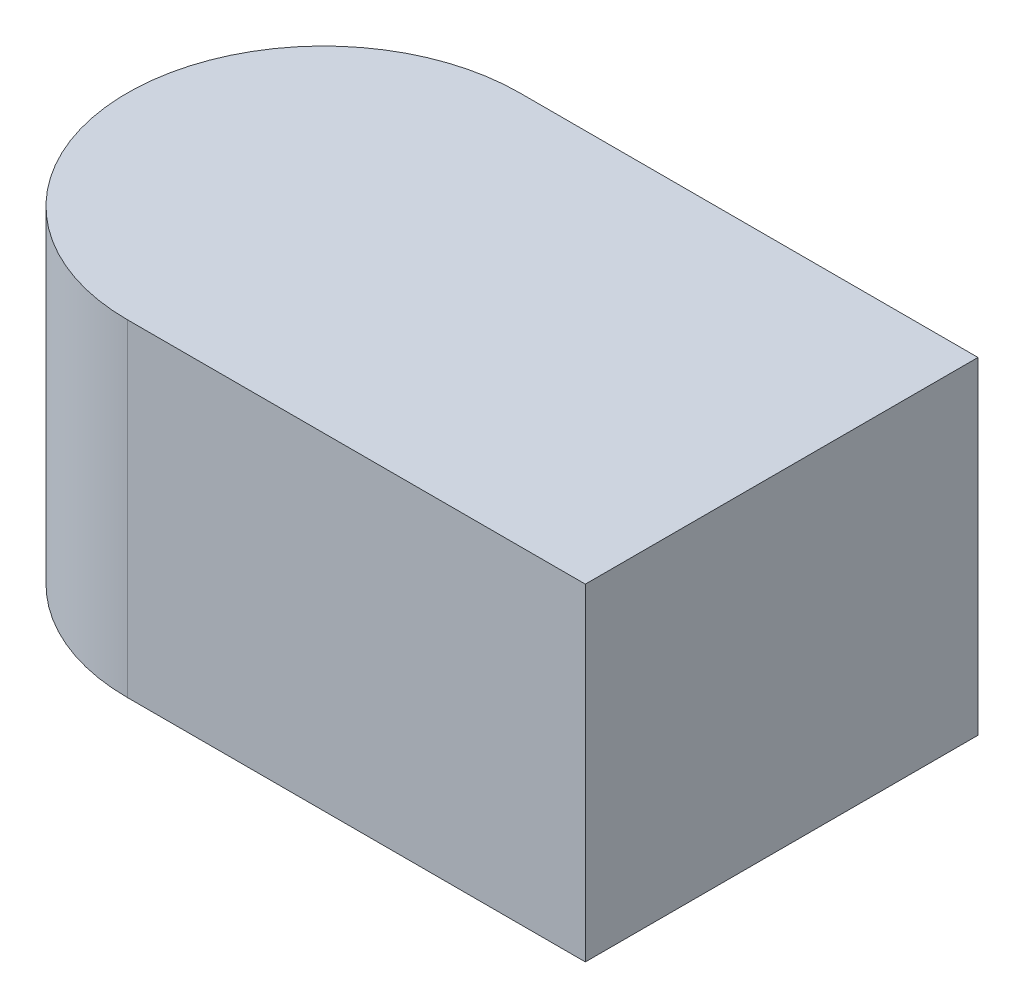
ISO-10303-21;
HEADER;
FILE_DESCRIPTION(('STEP AP214'),'2;1');
FILE_NAME('part.step','',(''),(''),'','','');
FILE_SCHEMA(('AUTOMOTIVE_DESIGN { 1 0 10303 214 1 1 1 1 }'));
ENDSEC;
DATA;
#1=APPLICATION_CONTEXT('core data for automotive mechanical design processes');
#2=APPLICATION_PROTOCOL_DEFINITION('international standard','automotive_design',2000,#1);
#3=PRODUCT_CONTEXT('',#1,'mechanical');
#4=PRODUCT('Part','Part','',(#3));
#5=PRODUCT_RELATED_PRODUCT_CATEGORY('part','',(#4));
#6=PRODUCT_DEFINITION_FORMATION('','',#4);
#7=PRODUCT_DEFINITION_CONTEXT('part definition',#1,'design');
#8=PRODUCT_DEFINITION('design','',#6,#7);
#9=PRODUCT_DEFINITION_SHAPE('','',#8);
#10=(LENGTH_UNIT() NAMED_UNIT(*) SI_UNIT(.MILLI.,.METRE.));
#11=(NAMED_UNIT(*) PLANE_ANGLE_UNIT() SI_UNIT($,.RADIAN.));
#12=(NAMED_UNIT(*) SI_UNIT($,.STERADIAN.) SOLID_ANGLE_UNIT());
#13=UNCERTAINTY_MEASURE_WITH_UNIT(LENGTH_MEASURE(1.E-05),#10,'distance_accuracy_value','');
#14=(GEOMETRIC_REPRESENTATION_CONTEXT(3) GLOBAL_UNCERTAINTY_ASSIGNED_CONTEXT((#13)) GLOBAL_UNIT_ASSIGNED_CONTEXT((#10,
#11,#12)) REPRESENTATION_CONTEXT('',''));
#15=CARTESIAN_POINT('',(0.,0.,0.));
#16=DIRECTION('',(0.,0.,1.));
#17=DIRECTION('',(1.,0.,0.));
#18=AXIS2_PLACEMENT_3D('',#15,#16,#17);
#19=CARTESIAN_POINT('',(0.,0.,0.));
#20=DIRECTION('',(0.,1.,0.));
#21=DIRECTION('',(1.,0.,0.));
#22=AXIS2_PLACEMENT_3D('',#19,#20,#21);
#23=PLANE('',#22);
#24=DIRECTION('',(0.,0.,-1.));
#25=VECTOR('',#24,1.);
#26=CARTESIAN_POINT('',(1.75,0.,1.87));
#27=LINE('',#26,#25);
#28=CARTESIAN_POINT('',(1.75,0.,1.87));
#29=VERTEX_POINT('',#28);
#30=CARTESIAN_POINT('',(1.75,0.,1.63));
#31=VERTEX_POINT('',#30);
#32=EDGE_CURVE('E11',#29,#31,#27,.T.);
#33=ORIENTED_EDGE('',*,*,#32,.F.);
#34=DIRECTION('',(1.,0.,0.));
#35=VECTOR('',#34,1.);
#36=CARTESIAN_POINT('',(1.47,0.,1.87));
#37=LINE('',#36,#35);
#38=CARTESIAN_POINT('',(1.47,0.,1.87));
#39=VERTEX_POINT('',#38);
#40=EDGE_CURVE('E24',#39,#29,#37,.T.);
#41=ORIENTED_EDGE('',*,*,#40,.F.);
#42=CARTESIAN_POINT('',(1.47,0.,1.75));
#43=DIRECTION('',(0.,1.,0.));
#44=DIRECTION('',(0.,0.,-1.));
#45=AXIS2_PLACEMENT_3D('',#42,#43,#44);
#46=CIRCLE('',#45,0.12);
#47=CARTESIAN_POINT('',(1.47,0.,1.63));
#48=VERTEX_POINT('',#47);
#49=EDGE_CURVE('E61',#48,#39,#46,.T.);
#50=ORIENTED_EDGE('',*,*,#49,.F.);
#51=DIRECTION('',(-1.,0.,0.));
#52=VECTOR('',#51,1.);
#53=CARTESIAN_POINT('',(1.75,0.,1.63));
#54=LINE('',#53,#52);
#55=EDGE_CURVE('E37',#31,#48,#54,.T.);
#56=ORIENTED_EDGE('',*,*,#55,.F.);
#57=EDGE_LOOP('',(#33,#41,#50,#56));
#58=FACE_BOUND('',#57,.T.);
#59=ADVANCED_FACE('F17',(#58),#23,.F.);
#60=CARTESIAN_POINT('',(1.75,0.,1.63));
#61=DIRECTION('',(0.,0.,-1.));
#62=DIRECTION('',(-1.,0.,0.));
#63=AXIS2_PLACEMENT_3D('',#60,#61,#62);
#64=PLANE('',#63);
#65=DIRECTION('',(0.,1.,0.));
#66=VECTOR('',#65,1.);
#67=CARTESIAN_POINT('',(1.47,0.,1.63));
#68=LINE('',#67,#66);
#69=CARTESIAN_POINT('',(1.47,0.2,1.63));
#70=VERTEX_POINT('',#69);
#71=EDGE_CURVE('E84',#48,#70,#68,.T.);
#72=ORIENTED_EDGE('',*,*,#71,.T.);
#73=DIRECTION('',(-1.,0.,0.));
#74=VECTOR('',#73,1.);
#75=CARTESIAN_POINT('',(1.75,0.2,1.63));
#76=LINE('',#75,#74);
#77=CARTESIAN_POINT('',(1.75,0.2,1.63));
#78=VERTEX_POINT('',#77);
#79=EDGE_CURVE('E74',#78,#70,#76,.T.);
#80=ORIENTED_EDGE('',*,*,#79,.F.);
#81=DIRECTION('',(0.,1.,0.));
#82=VECTOR('',#81,1.);
#83=CARTESIAN_POINT('',(1.75,0.,1.63));
#84=LINE('',#83,#82);
#85=EDGE_CURVE('E81',#31,#78,#84,.T.);
#86=ORIENTED_EDGE('',*,*,#85,.F.);
#87=ORIENTED_EDGE('',*,*,#55,.T.);
#88=EDGE_LOOP('',(#72,#80,#86,#87));
#89=FACE_BOUND('',#88,.T.);
#90=ADVANCED_FACE('F89',(#89),#64,.T.);
#91=CARTESIAN_POINT('',(1.75,0.,1.87));
#92=DIRECTION('',(1.,0.,0.));
#93=DIRECTION('',(0.,0.,-1.));
#94=AXIS2_PLACEMENT_3D('',#91,#92,#93);
#95=PLANE('',#94);
#96=ORIENTED_EDGE('',*,*,#85,.T.);
#97=DIRECTION('',(0.,0.,-1.));
#98=VECTOR('',#97,1.);
#99=CARTESIAN_POINT('',(1.75,0.2,1.87));
#100=LINE('',#99,#98);
#101=CARTESIAN_POINT('',(1.75,0.2,1.87));
#102=VERTEX_POINT('',#101);
#103=EDGE_CURVE('E79',#102,#78,#100,.T.);
#104=ORIENTED_EDGE('',*,*,#103,.F.);
#105=DIRECTION('',(0.,1.,0.));
#106=VECTOR('',#105,1.);
#107=CARTESIAN_POINT('',(1.75,0.,1.87));
#108=LINE('',#107,#106);
#109=EDGE_CURVE('E67',#29,#102,#108,.T.);
#110=ORIENTED_EDGE('',*,*,#109,.F.);
#111=ORIENTED_EDGE('',*,*,#32,.T.);
#112=EDGE_LOOP('',(#96,#104,#110,#111));
#113=FACE_BOUND('',#112,.T.);
#114=ADVANCED_FACE('F91',(#113),#95,.T.);
#115=CARTESIAN_POINT('',(1.47,0.,1.87));
#116=DIRECTION('',(0.,0.,1.));
#117=DIRECTION('',(1.,0.,0.));
#118=AXIS2_PLACEMENT_3D('',#115,#116,#117);
#119=PLANE('',#118);
#120=ORIENTED_EDGE('',*,*,#109,.T.);
#121=DIRECTION('',(1.,0.,0.));
#122=VECTOR('',#121,1.);
#123=CARTESIAN_POINT('',(1.47,0.2,1.87));
#124=LINE('',#123,#122);
#125=CARTESIAN_POINT('',(1.47,0.2,1.87));
#126=VERTEX_POINT('',#125);
#127=EDGE_CURVE('E62',#126,#102,#124,.T.);
#128=ORIENTED_EDGE('',*,*,#127,.F.);
#129=DIRECTION('',(0.,1.,0.));
#130=VECTOR('',#129,1.);
#131=CARTESIAN_POINT('',(1.47,0.,1.87));
#132=LINE('',#131,#130);
#133=EDGE_CURVE('E55',#39,#126,#132,.T.);
#134=ORIENTED_EDGE('',*,*,#133,.F.);
#135=ORIENTED_EDGE('',*,*,#40,.T.);
#136=EDGE_LOOP('',(#120,#128,#134,#135));
#137=FACE_BOUND('',#136,.T.);
#138=ADVANCED_FACE('F65',(#137),#119,.T.);
#139=CARTESIAN_POINT('',(1.47,0.,1.75));
#140=DIRECTION('',(0.,1.,0.));
#141=DIRECTION('',(1.,0.,0.));
#142=AXIS2_PLACEMENT_3D('',#139,#140,#141);
#143=CYLINDRICAL_SURFACE('',#142,0.12);
#144=ORIENTED_EDGE('',*,*,#133,.T.);
#145=CARTESIAN_POINT('',(1.47,0.2,1.75));
#146=DIRECTION('',(0.,1.,0.));
#147=DIRECTION('',(0.,0.,-1.));
#148=AXIS2_PLACEMENT_3D('',#145,#146,#147);
#149=CIRCLE('',#148,0.12);
#150=EDGE_CURVE('E60',#70,#126,#149,.T.);
#151=ORIENTED_EDGE('',*,*,#150,.F.);
#152=ORIENTED_EDGE('',*,*,#71,.F.);
#153=ORIENTED_EDGE('',*,*,#49,.T.);
#154=EDGE_LOOP('',(#144,#151,#152,#153));
#155=FACE_BOUND('',#154,.T.);
#156=ADVANCED_FACE('F57',(#155),#143,.T.);
#157=CARTESIAN_POINT('',(0.,0.2,0.));
#158=DIRECTION('',(0.,1.,0.));
#159=DIRECTION('',(1.,0.,0.));
#160=AXIS2_PLACEMENT_3D('',#157,#158,#159);
#161=PLANE('',#160);
#162=ORIENTED_EDGE('',*,*,#150,.T.);
#163=ORIENTED_EDGE('',*,*,#127,.T.);
#164=ORIENTED_EDGE('',*,*,#103,.T.);
#165=ORIENTED_EDGE('',*,*,#79,.T.);
#166=EDGE_LOOP('',(#162,#163,#164,#165));
#167=FACE_BOUND('',#166,.T.);
#168=ADVANCED_FACE('F72',(#167),#161,.T.);
#169=CLOSED_SHELL('',(#59,#90,#114,#138,#156,#168));
#170=MANIFOLD_SOLID_BREP('B1',#169);
#171=ADVANCED_BREP_SHAPE_REPRESENTATION('',(#18,#170),#14);
#172=SHAPE_DEFINITION_REPRESENTATION(#9,#171);
ENDSEC;
END-ISO-10303-21;
